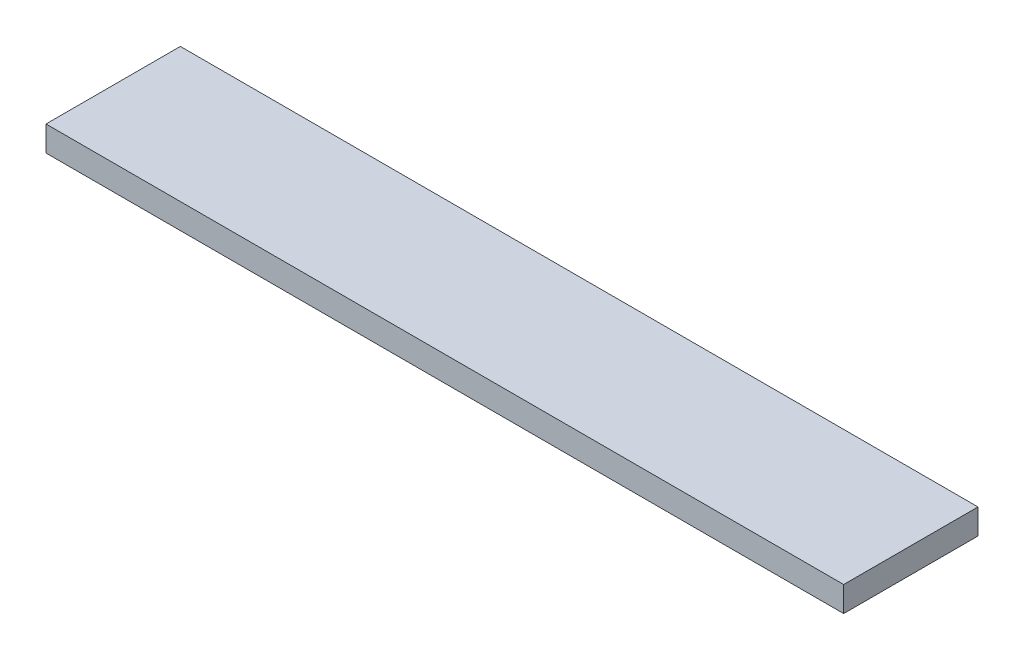
ISO-10303-21;
HEADER;
FILE_DESCRIPTION(('STEP AP214'),'2;1');
FILE_NAME('part.step','',(''),(''),'','','');
FILE_SCHEMA(('AUTOMOTIVE_DESIGN { 1 0 10303 214 1 1 1 1 }'));
ENDSEC;
DATA;
#1=APPLICATION_CONTEXT('core data for automotive mechanical design processes');
#2=APPLICATION_PROTOCOL_DEFINITION('international standard','automotive_design',2000,#1);
#3=PRODUCT_CONTEXT('',#1,'mechanical');
#4=PRODUCT('Part','Part','',(#3));
#5=PRODUCT_RELATED_PRODUCT_CATEGORY('part','',(#4));
#6=PRODUCT_DEFINITION_FORMATION('','',#4);
#7=PRODUCT_DEFINITION_CONTEXT('part definition',#1,'design');
#8=PRODUCT_DEFINITION('design','',#6,#7);
#9=PRODUCT_DEFINITION_SHAPE('','',#8);
#10=(LENGTH_UNIT() NAMED_UNIT(*) SI_UNIT(.MILLI.,.METRE.));
#11=(NAMED_UNIT(*) PLANE_ANGLE_UNIT() SI_UNIT($,.RADIAN.));
#12=(NAMED_UNIT(*) SI_UNIT($,.STERADIAN.) SOLID_ANGLE_UNIT());
#13=UNCERTAINTY_MEASURE_WITH_UNIT(LENGTH_MEASURE(1.E-05),#10,'distance_accuracy_value','');
#14=(GEOMETRIC_REPRESENTATION_CONTEXT(3) GLOBAL_UNCERTAINTY_ASSIGNED_CONTEXT((#13)) GLOBAL_UNIT_ASSIGNED_CONTEXT((#10,
#11,#12)) REPRESENTATION_CONTEXT('',''));
#15=CARTESIAN_POINT('',(0.,0.,0.));
#16=DIRECTION('',(0.,0.,1.));
#17=DIRECTION('',(1.,0.,0.));
#18=AXIS2_PLACEMENT_3D('',#15,#16,#17);
#19=CARTESIAN_POINT('',(47.5,3.,8.));
#20=DIRECTION('',(-1.,0.,0.));
#21=DIRECTION('',(0.,0.,1.));
#22=AXIS2_PLACEMENT_3D('',#19,#20,#21);
#23=PLANE('',#22);
#24=DIRECTION('',(0.,0.,-1.));
#25=VECTOR('',#24,1.);
#26=CARTESIAN_POINT('',(47.5,0.,8.));
#27=LINE('',#26,#25);
#28=CARTESIAN_POINT('',(47.5,0.,8.));
#29=VERTEX_POINT('',#28);
#30=CARTESIAN_POINT('',(47.5,0.,-8.));
#31=VERTEX_POINT('',#30);
#32=EDGE_CURVE('E111',#29,#31,#27,.T.);
#33=ORIENTED_EDGE('',*,*,#32,.T.);
#34=DIRECTION('',(0.,-1.,0.));
#35=VECTOR('',#34,1.);
#36=CARTESIAN_POINT('',(47.5,3.,-8.));
#37=LINE('',#36,#35);
#38=CARTESIAN_POINT('',(47.5,3.,-8.));
#39=VERTEX_POINT('',#38);
#40=EDGE_CURVE('E11',#39,#31,#37,.T.);
#41=ORIENTED_EDGE('',*,*,#40,.F.);
#42=DIRECTION('',(0.,0.,-1.));
#43=VECTOR('',#42,1.);
#44=CARTESIAN_POINT('',(47.5,3.,8.));
#45=LINE('',#44,#43);
#46=CARTESIAN_POINT('',(47.5,3.,8.));
#47=VERTEX_POINT('',#46);
#48=EDGE_CURVE('E95',#47,#39,#45,.T.);
#49=ORIENTED_EDGE('',*,*,#48,.F.);
#50=DIRECTION('',(0.,-1.,0.));
#51=VECTOR('',#50,1.);
#52=CARTESIAN_POINT('',(47.5,3.,8.));
#53=LINE('',#52,#51);
#54=EDGE_CURVE('E107',#47,#29,#53,.T.);
#55=ORIENTED_EDGE('',*,*,#54,.T.);
#56=EDGE_LOOP('',(#33,#41,#49,#55));
#57=FACE_BOUND('',#56,.T.);
#58=ADVANCED_FACE('F43',(#57),#23,.F.);
#59=CARTESIAN_POINT('',(-47.5,3.,-8.));
#60=DIRECTION('',(0.,0.,1.));
#61=DIRECTION('',(1.,0.,0.));
#62=AXIS2_PLACEMENT_3D('',#59,#60,#61);
#63=PLANE('',#62);
#64=DIRECTION('',(-1.,0.,0.));
#65=VECTOR('',#64,1.);
#66=CARTESIAN_POINT('',(-47.5,0.,-8.));
#67=LINE('',#66,#65);
#68=CARTESIAN_POINT('',(-47.5,0.,-8.));
#69=VERTEX_POINT('',#68);
#70=EDGE_CURVE('E100',#31,#69,#67,.T.);
#71=ORIENTED_EDGE('',*,*,#70,.T.);
#72=DIRECTION('',(0.,-1.,0.));
#73=VECTOR('',#72,1.);
#74=CARTESIAN_POINT('',(-47.5,3.,-8.));
#75=LINE('',#74,#73);
#76=CARTESIAN_POINT('',(-47.5,3.,-8.));
#77=VERTEX_POINT('',#76);
#78=EDGE_CURVE('E52',#77,#69,#75,.T.);
#79=ORIENTED_EDGE('',*,*,#78,.F.);
#80=DIRECTION('',(-1.,0.,0.));
#81=VECTOR('',#80,1.);
#82=CARTESIAN_POINT('',(-47.5,3.,-8.));
#83=LINE('',#82,#81);
#84=EDGE_CURVE('E90',#39,#77,#83,.T.);
#85=ORIENTED_EDGE('',*,*,#84,.F.);
#86=ORIENTED_EDGE('',*,*,#40,.T.);
#87=EDGE_LOOP('',(#71,#79,#85,#86));
#88=FACE_BOUND('',#87,.T.);
#89=ADVANCED_FACE('F99',(#88),#63,.F.);
#90=CARTESIAN_POINT('',(-47.5,3.,8.));
#91=DIRECTION('',(1.,0.,0.));
#92=DIRECTION('',(0.,0.,-1.));
#93=AXIS2_PLACEMENT_3D('',#90,#91,#92);
#94=PLANE('',#93);
#95=DIRECTION('',(0.,0.,1.));
#96=VECTOR('',#95,1.);
#97=CARTESIAN_POINT('',(-47.5,0.,8.));
#98=LINE('',#97,#96);
#99=CARTESIAN_POINT('',(-47.5,0.,8.));
#100=VERTEX_POINT('',#99);
#101=EDGE_CURVE('E77',#69,#100,#98,.T.);
#102=ORIENTED_EDGE('',*,*,#101,.T.);
#103=DIRECTION('',(0.,-1.,0.));
#104=VECTOR('',#103,1.);
#105=CARTESIAN_POINT('',(-47.5,3.,8.));
#106=LINE('',#105,#104);
#107=CARTESIAN_POINT('',(-47.5,3.,8.));
#108=VERTEX_POINT('',#107);
#109=EDGE_CURVE('E102',#108,#100,#106,.T.);
#110=ORIENTED_EDGE('',*,*,#109,.F.);
#111=DIRECTION('',(0.,0.,1.));
#112=VECTOR('',#111,1.);
#113=CARTESIAN_POINT('',(-47.5,3.,8.));
#114=LINE('',#113,#112);
#115=EDGE_CURVE('E93',#77,#108,#114,.T.);
#116=ORIENTED_EDGE('',*,*,#115,.F.);
#117=ORIENTED_EDGE('',*,*,#78,.T.);
#118=EDGE_LOOP('',(#102,#110,#116,#117));
#119=FACE_BOUND('',#118,.T.);
#120=ADVANCED_FACE('F103',(#119),#94,.F.);
#121=CARTESIAN_POINT('',(-47.5,3.,8.));
#122=DIRECTION('',(0.,0.,-1.));
#123=DIRECTION('',(-1.,0.,0.));
#124=AXIS2_PLACEMENT_3D('',#121,#122,#123);
#125=PLANE('',#124);
#126=DIRECTION('',(1.,0.,0.));
#127=VECTOR('',#126,1.);
#128=CARTESIAN_POINT('',(-47.5,0.,8.));
#129=LINE('',#128,#127);
#130=EDGE_CURVE('E83',#100,#29,#129,.T.);
#131=ORIENTED_EDGE('',*,*,#130,.T.);
#132=ORIENTED_EDGE('',*,*,#54,.F.);
#133=DIRECTION('',(1.,0.,0.));
#134=VECTOR('',#133,1.);
#135=CARTESIAN_POINT('',(-47.5,3.,8.));
#136=LINE('',#135,#134);
#137=EDGE_CURVE('E60',#108,#47,#136,.T.);
#138=ORIENTED_EDGE('',*,*,#137,.F.);
#139=ORIENTED_EDGE('',*,*,#109,.T.);
#140=EDGE_LOOP('',(#131,#132,#138,#139));
#141=FACE_BOUND('',#140,.T.);
#142=ADVANCED_FACE('F124',(#141),#125,.F.);
#143=CARTESIAN_POINT('',(0.,3.,0.));
#144=DIRECTION('',(0.,-1.,0.));
#145=DIRECTION('',(0.,0.,-1.));
#146=AXIS2_PLACEMENT_3D('',#143,#144,#145);
#147=PLANE('',#146);
#148=ORIENTED_EDGE('',*,*,#48,.T.);
#149=ORIENTED_EDGE('',*,*,#84,.T.);
#150=ORIENTED_EDGE('',*,*,#115,.T.);
#151=ORIENTED_EDGE('',*,*,#137,.T.);
#152=EDGE_LOOP('',(#148,#149,#150,#151));
#153=FACE_BOUND('',#152,.T.);
#154=ADVANCED_FACE('F91',(#153),#147,.F.);
#155=CARTESIAN_POINT('',(0.,0.,0.));
#156=DIRECTION('',(0.,-1.,0.));
#157=DIRECTION('',(0.,0.,-1.));
#158=AXIS2_PLACEMENT_3D('',#155,#156,#157);
#159=PLANE('',#158);
#160=ORIENTED_EDGE('',*,*,#32,.F.);
#161=ORIENTED_EDGE('',*,*,#130,.F.);
#162=ORIENTED_EDGE('',*,*,#101,.F.);
#163=ORIENTED_EDGE('',*,*,#70,.F.);
#164=EDGE_LOOP('',(#160,#161,#162,#163));
#165=FACE_BOUND('',#164,.T.);
#166=ADVANCED_FACE('F127',(#165),#159,.T.);
#167=CLOSED_SHELL('',(#58,#89,#120,#142,#154,#166));
#168=MANIFOLD_SOLID_BREP('B2',#167);
#169=ADVANCED_BREP_SHAPE_REPRESENTATION('',(#18,#168),#14);
#170=SHAPE_DEFINITION_REPRESENTATION(#9,#169);
ENDSEC;
END-ISO-10303-21;
